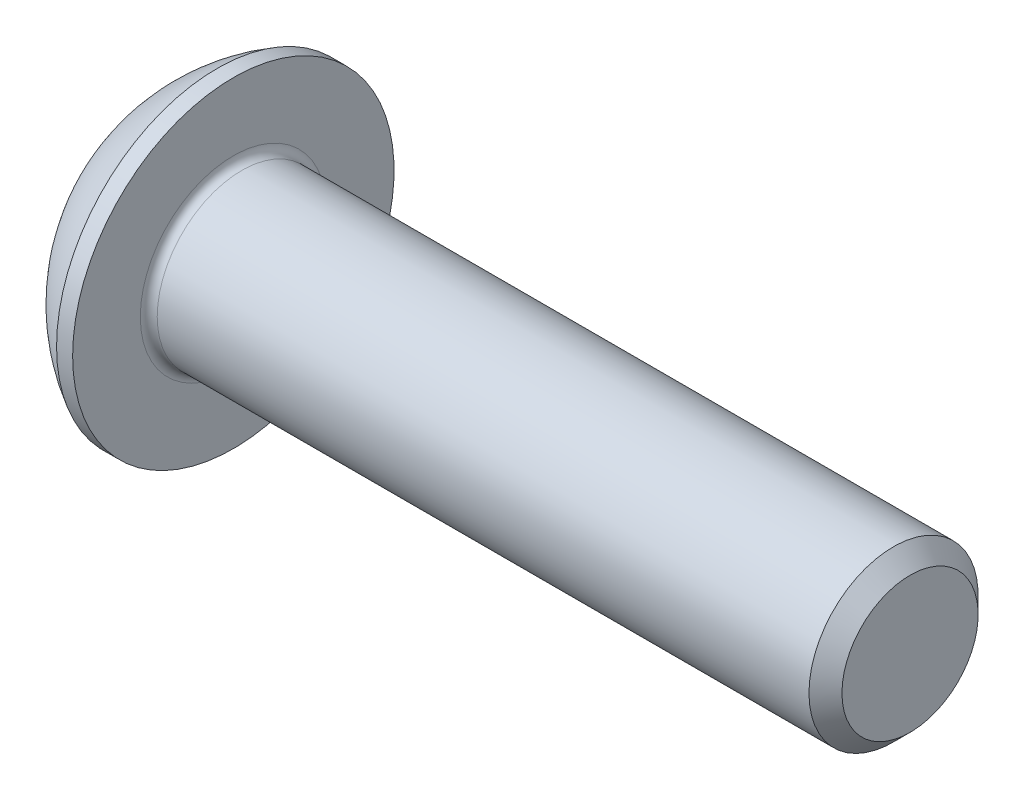
ISO-10303-21;
HEADER;
FILE_DESCRIPTION(('STEP AP214'),'2;1');
FILE_NAME('part.step','',(''),(''),'','','');
FILE_SCHEMA(('AUTOMOTIVE_DESIGN { 1 0 10303 214 1 1 1 1 }'));
ENDSEC;
DATA;
#1=APPLICATION_CONTEXT('core data for automotive mechanical design processes');
#2=APPLICATION_PROTOCOL_DEFINITION('international standard','automotive_design',2000,#1);
#3=PRODUCT_CONTEXT('',#1,'mechanical');
#4=PRODUCT('Part','Part','',(#3));
#5=PRODUCT_RELATED_PRODUCT_CATEGORY('part','',(#4));
#6=PRODUCT_DEFINITION_FORMATION('','',#4);
#7=PRODUCT_DEFINITION_CONTEXT('part definition',#1,'design');
#8=PRODUCT_DEFINITION('design','',#6,#7);
#9=PRODUCT_DEFINITION_SHAPE('','',#8);
#10=(LENGTH_UNIT() NAMED_UNIT(*) SI_UNIT(.MILLI.,.METRE.));
#11=(NAMED_UNIT(*) PLANE_ANGLE_UNIT() SI_UNIT($,.RADIAN.));
#12=(NAMED_UNIT(*) SI_UNIT($,.STERADIAN.) SOLID_ANGLE_UNIT());
#13=UNCERTAINTY_MEASURE_WITH_UNIT(LENGTH_MEASURE(1.E-05),#10,'distance_accuracy_value','');
#14=(GEOMETRIC_REPRESENTATION_CONTEXT(3) GLOBAL_UNCERTAINTY_ASSIGNED_CONTEXT((#13)) GLOBAL_UNIT_ASSIGNED_CONTEXT((#10,
#11,#12)) REPRESENTATION_CONTEXT('',''));
#15=CARTESIAN_POINT('',(0.,0.,0.));
#16=DIRECTION('',(0.,0.,1.));
#17=DIRECTION('',(1.,0.,0.));
#18=AXIS2_PLACEMENT_3D('',#15,#16,#17);
#19=CARTESIAN_POINT('',(0.,0.,0.));
#20=DIRECTION('',(-1.,0.,0.));
#21=DIRECTION('',(0.,0.,1.));
#22=AXIS2_PLACEMENT_3D('',#19,#20,#21);
#23=PLANE('',#22);
#24=CARTESIAN_POINT('',(0.,0.,0.));
#25=DIRECTION('',(-1.,0.,0.));
#26=DIRECTION('',(0.,0.,1.));
#27=AXIS2_PLACEMENT_3D('',#24,#25,#26);
#28=CIRCLE('',#27,1.9);
#29=CARTESIAN_POINT('',(0.,0.,1.9));
#30=VERTEX_POINT('',#29);
#31=EDGE_CURVE('E155',#30,#30,#28,.T.);
#32=ORIENTED_EDGE('',*,*,#31,.T.);
#33=EDGE_LOOP('',(#32));
#34=FACE_BOUND('',#33,.T.);
#35=DIRECTION('',(0.,-1.,0.));
#36=VECTOR('',#35,1.);
#37=CARTESIAN_POINT('',(0.,-0.721687836487032,1.25));
#38=LINE('',#37,#36);
#39=CARTESIAN_POINT('',(0.,0.721687836487033,1.25));
#40=VERTEX_POINT('',#39);
#41=CARTESIAN_POINT('',(0.,-0.721687836487032,1.25));
#42=VERTEX_POINT('',#41);
#43=EDGE_CURVE('E45',#40,#42,#38,.T.);
#44=ORIENTED_EDGE('',*,*,#43,.T.);
#45=DIRECTION('',(0.,-0.499999999999999,-0.866025403784439));
#46=VECTOR('',#45,1.);
#47=CARTESIAN_POINT('',(0.,-1.44337567297406,0.));
#48=LINE('',#47,#46);
#49=CARTESIAN_POINT('',(0.,-1.44337567297406,0.));
#50=VERTEX_POINT('',#49);
#51=EDGE_CURVE('E248',#42,#50,#48,.T.);
#52=ORIENTED_EDGE('',*,*,#51,.T.);
#53=DIRECTION('',(0.,0.5,-0.866025403784439));
#54=VECTOR('',#53,1.);
#55=CARTESIAN_POINT('',(0.,-0.721687836487031,-1.25));
#56=LINE('',#55,#54);
#57=CARTESIAN_POINT('',(0.,-0.721687836487031,-1.25));
#58=VERTEX_POINT('',#57);
#59=EDGE_CURVE('E130',#50,#58,#56,.T.);
#60=ORIENTED_EDGE('',*,*,#59,.T.);
#61=DIRECTION('',(0.,1.,0.));
#62=VECTOR('',#61,1.);
#63=CARTESIAN_POINT('',(0.,0.721687836487033,-1.25));
#64=LINE('',#63,#62);
#65=CARTESIAN_POINT('',(0.,0.721687836487033,-1.25));
#66=VERTEX_POINT('',#65);
#67=EDGE_CURVE('E251',#58,#66,#64,.T.);
#68=ORIENTED_EDGE('',*,*,#67,.T.);
#69=DIRECTION('',(0.,0.5,0.866025403784439));
#70=VECTOR('',#69,1.);
#71=CARTESIAN_POINT('',(0.,1.44337567297407,0.));
#72=LINE('',#71,#70);
#73=CARTESIAN_POINT('',(0.,1.44337567297407,0.));
#74=VERTEX_POINT('',#73);
#75=EDGE_CURVE('E253',#66,#74,#72,.T.);
#76=ORIENTED_EDGE('',*,*,#75,.T.);
#77=DIRECTION('',(0.,-0.5,0.866025403784439));
#78=VECTOR('',#77,1.);
#79=CARTESIAN_POINT('',(0.,0.721687836487033,1.25));
#80=LINE('',#79,#78);
#81=EDGE_CURVE('E255',#74,#40,#80,.T.);
#82=ORIENTED_EDGE('',*,*,#81,.T.);
#83=EDGE_LOOP('',(#44,#52,#60,#68,#76,#82));
#84=FACE_BOUND('',#83,.T.);
#85=ADVANCED_FACE('F30',(#34,#84),#23,.T.);
#86=CARTESIAN_POINT('',(3.88527472527473,0.,0.));
#87=DIRECTION('',(-1.,0.,0.));
#88=DIRECTION('',(0.,1.,0.));
#89=AXIS2_PLACEMENT_3D('',#86,#87,#88);
#90=SPHERICAL_SURFACE('',#89,4.32496932831421);
#91=CARTESIAN_POINT('',(1.82,0.,0.));
#92=DIRECTION('',(-1.,0.,0.));
#93=DIRECTION('',(0.,0.,1.));
#94=AXIS2_PLACEMENT_3D('',#91,#92,#93);
#95=CIRCLE('',#94,3.8);
#96=CARTESIAN_POINT('',(1.82,0.,3.8));
#97=VERTEX_POINT('',#96);
#98=EDGE_CURVE('E152',#97,#97,#95,.T.);
#99=ORIENTED_EDGE('',*,*,#98,.T.);
#100=EDGE_LOOP('',(#99));
#101=FACE_BOUND('',#100,.T.);
#102=ORIENTED_EDGE('',*,*,#31,.F.);
#103=EDGE_LOOP('',(#102));
#104=FACE_BOUND('',#103,.T.);
#105=ADVANCED_FACE('F176',(#101,#104),#90,.T.);
#106=CARTESIAN_POINT('',(0.,0.,0.));
#107=DIRECTION('',(-1.,0.,0.));
#108=DIRECTION('',(0.,0.,1.));
#109=AXIS2_PLACEMENT_3D('',#106,#107,#108);
#110=CYLINDRICAL_SURFACE('',#109,3.8);
#111=ORIENTED_EDGE('',*,*,#98,.F.);
#112=EDGE_LOOP('',(#111));
#113=FACE_BOUND('',#112,.T.);
#114=CARTESIAN_POINT('',(2.2,0.,0.));
#115=DIRECTION('',(-1.,0.,0.));
#116=DIRECTION('',(0.,0.,1.));
#117=AXIS2_PLACEMENT_3D('',#114,#115,#116);
#118=CIRCLE('',#117,3.8);
#119=CARTESIAN_POINT('',(2.2,0.,3.8));
#120=VERTEX_POINT('',#119);
#121=EDGE_CURVE('E149',#120,#120,#118,.T.);
#122=ORIENTED_EDGE('',*,*,#121,.T.);
#123=EDGE_LOOP('',(#122));
#124=FACE_BOUND('',#123,.T.);
#125=ADVANCED_FACE('F181',(#113,#124),#110,.T.);
#126=CARTESIAN_POINT('',(2.2,2.,0.));
#127=DIRECTION('',(-1.,0.,0.));
#128=DIRECTION('',(0.,0.,1.));
#129=AXIS2_PLACEMENT_3D('',#126,#127,#128);
#130=PLANE('',#129);
#131=CARTESIAN_POINT('',(2.2,0.,0.));
#132=DIRECTION('',(-1.,0.,0.));
#133=DIRECTION('',(0.,0.,1.));
#134=AXIS2_PLACEMENT_3D('',#131,#132,#133);
#135=CIRCLE('',#134,2.2);
#136=CARTESIAN_POINT('',(2.2,0.,2.2));
#137=VERTEX_POINT('',#136);
#138=EDGE_CURVE('E38',#137,#137,#135,.T.);
#139=ORIENTED_EDGE('',*,*,#138,.T.);
#140=EDGE_LOOP('',(#139));
#141=FACE_BOUND('',#140,.T.);
#142=ORIENTED_EDGE('',*,*,#121,.F.);
#143=EDGE_LOOP('',(#142));
#144=FACE_BOUND('',#143,.T.);
#145=ADVANCED_FACE('F160',(#141,#144),#130,.F.);
#146=CARTESIAN_POINT('',(0.,0.,0.));
#147=DIRECTION('',(-1.,0.,0.));
#148=DIRECTION('',(0.,0.,1.));
#149=AXIS2_PLACEMENT_3D('',#146,#147,#148);
#150=CYLINDRICAL_SURFACE('',#149,2.);
#151=CARTESIAN_POINT('',(2.4,0.,0.));
#152=DIRECTION('',(-1.,0.,0.));
#153=DIRECTION('',(0.,0.,1.));
#154=AXIS2_PLACEMENT_3D('',#151,#152,#153);
#155=CIRCLE('',#154,2.);
#156=CARTESIAN_POINT('',(2.4,0.,2.));
#157=VERTEX_POINT('',#156);
#158=EDGE_CURVE('E11',#157,#157,#155,.F.);
#159=ORIENTED_EDGE('',*,*,#158,.T.);
#160=EDGE_LOOP('',(#159));
#161=FACE_BOUND('',#160,.T.);
#162=CARTESIAN_POINT('',(17.81,0.,0.));
#163=DIRECTION('',(-1.,0.,0.));
#164=DIRECTION('',(0.,0.,1.));
#165=AXIS2_PLACEMENT_3D('',#162,#163,#164);
#166=CIRCLE('',#165,2.);
#167=CARTESIAN_POINT('',(17.81,0.,2.));
#168=VERTEX_POINT('',#167);
#169=EDGE_CURVE('E146',#168,#168,#166,.T.);
#170=ORIENTED_EDGE('',*,*,#169,.T.);
#171=EDGE_LOOP('',(#170));
#172=FACE_BOUND('',#171,.T.);
#173=ADVANCED_FACE('F190',(#161,#172),#150,.T.);
#174=CARTESIAN_POINT('',(18.2,0.,0.));
#175=DIRECTION('',(-1.,0.,0.));
#176=DIRECTION('',(0.,0.,1.));
#177=AXIS2_PLACEMENT_3D('',#174,#175,#176);
#178=CONICAL_SURFACE('',#177,1.61,0.78539816339746);
#179=ORIENTED_EDGE('',*,*,#169,.F.);
#180=EDGE_LOOP('',(#179));
#181=FACE_BOUND('',#180,.T.);
#182=CARTESIAN_POINT('',(18.2,0.,0.));
#183=DIRECTION('',(-1.,0.,0.));
#184=DIRECTION('',(0.,0.,1.));
#185=AXIS2_PLACEMENT_3D('',#182,#183,#184);
#186=CIRCLE('',#185,1.61);
#187=CARTESIAN_POINT('',(18.2,0.,1.61));
#188=VERTEX_POINT('',#187);
#189=EDGE_CURVE('E142',#188,#188,#186,.T.);
#190=ORIENTED_EDGE('',*,*,#189,.T.);
#191=EDGE_LOOP('',(#190));
#192=FACE_BOUND('',#191,.T.);
#193=ADVANCED_FACE('F171',(#181,#192),#178,.T.);
#194=CARTESIAN_POINT('',(18.2,0.,0.));
#195=DIRECTION('',(-1.,0.,0.));
#196=DIRECTION('',(0.,0.,1.));
#197=AXIS2_PLACEMENT_3D('',#194,#195,#196);
#198=PLANE('',#197);
#199=ORIENTED_EDGE('',*,*,#189,.F.);
#200=EDGE_LOOP('',(#199));
#201=FACE_BOUND('',#200,.T.);
#202=ADVANCED_FACE('F164',(#201),#198,.F.);
#203=CARTESIAN_POINT('',(2.4,0.,0.));
#204=DIRECTION('',(-1.,0.,0.));
#205=DIRECTION('',(0.,0.,1.));
#206=AXIS2_PLACEMENT_3D('',#203,#204,#205);
#207=TOROIDAL_SURFACE('',#206,2.2,0.2);
#208=ORIENTED_EDGE('',*,*,#158,.F.);
#209=EDGE_LOOP('',(#208));
#210=FACE_BOUND('',#209,.T.);
#211=ORIENTED_EDGE('',*,*,#138,.F.);
#212=EDGE_LOOP('',(#211));
#213=FACE_BOUND('',#212,.T.);
#214=ADVANCED_FACE('F32',(#210,#213),#207,.F.);
#215=CARTESIAN_POINT('',(1.3,-1.44337567297406,0.));
#216=DIRECTION('',(0.,0.866025403784439,-0.499999999999999));
#217=DIRECTION('',(0.,0.499999999999999,0.866025403784439));
#218=AXIS2_PLACEMENT_3D('',#215,#216,#217);
#219=PLANE('',#218);
#220=DIRECTION('',(0.,-0.499999999999999,-0.866025403784439));
#221=VECTOR('',#220,1.);
#222=CARTESIAN_POINT('',(1.3,-1.44337567297406,0.));
#223=LINE('',#222,#221);
#224=CARTESIAN_POINT('',(1.3,-0.721687836487032,1.25));
#225=VERTEX_POINT('',#224);
#226=CARTESIAN_POINT('',(1.3,-1.08253175473055,0.624999999999999));
#227=VERTEX_POINT('',#226);
#228=EDGE_CURVE('E113',#225,#227,#223,.T.);
#229=ORIENTED_EDGE('',*,*,#228,.T.);
#230=CARTESIAN_POINT('',(1.3,-1.44337567297406,0.));
#231=VERTEX_POINT('',#230);
#232=EDGE_CURVE('E106',#227,#231,#223,.T.);
#233=ORIENTED_EDGE('',*,*,#232,.T.);
#234=DIRECTION('',(-1.,0.,0.));
#235=VECTOR('',#234,1.);
#236=CARTESIAN_POINT('',(1.3,-1.44337567297406,0.));
#237=LINE('',#236,#235);
#238=EDGE_CURVE('E110',#231,#50,#237,.T.);
#239=ORIENTED_EDGE('',*,*,#238,.T.);
#240=ORIENTED_EDGE('',*,*,#51,.F.);
#241=DIRECTION('',(-1.,0.,0.));
#242=VECTOR('',#241,1.);
#243=CARTESIAN_POINT('',(1.3,-0.721687836487032,1.25));
#244=LINE('',#243,#242);
#245=EDGE_CURVE('E238',#225,#42,#244,.T.);
#246=ORIENTED_EDGE('',*,*,#245,.F.);
#247=EDGE_LOOP('',(#229,#233,#239,#240,#246));
#248=FACE_BOUND('',#247,.T.);
#249=ADVANCED_FACE('F108',(#248),#219,.T.);
#250=CARTESIAN_POINT('',(1.3,-0.721687836487031,-1.25));
#251=DIRECTION('',(0.,0.866025403784439,0.5));
#252=DIRECTION('',(0.,-0.5,0.866025403784439));
#253=AXIS2_PLACEMENT_3D('',#250,#251,#252);
#254=PLANE('',#253);
#255=DIRECTION('',(0.,0.5,-0.866025403784439));
#256=VECTOR('',#255,1.);
#257=CARTESIAN_POINT('',(1.3,-0.721687836487031,-1.25));
#258=LINE('',#257,#256);
#259=CARTESIAN_POINT('',(1.3,-1.08253175473055,-0.624999999999999));
#260=VERTEX_POINT('',#259);
#261=EDGE_CURVE('E118',#231,#260,#258,.T.);
#262=ORIENTED_EDGE('',*,*,#261,.T.);
#263=CARTESIAN_POINT('',(1.3,-0.721687836487031,-1.25));
#264=VERTEX_POINT('',#263);
#265=EDGE_CURVE('E125',#260,#264,#258,.T.);
#266=ORIENTED_EDGE('',*,*,#265,.T.);
#267=DIRECTION('',(-1.,0.,0.));
#268=VECTOR('',#267,1.);
#269=CARTESIAN_POINT('',(1.3,-0.721687836487031,-1.25));
#270=LINE('',#269,#268);
#271=EDGE_CURVE('E132',#264,#58,#270,.T.);
#272=ORIENTED_EDGE('',*,*,#271,.T.);
#273=ORIENTED_EDGE('',*,*,#59,.F.);
#274=ORIENTED_EDGE('',*,*,#238,.F.);
#275=EDGE_LOOP('',(#262,#266,#272,#273,#274));
#276=FACE_BOUND('',#275,.T.);
#277=ADVANCED_FACE('F128',(#276),#254,.T.);
#278=CARTESIAN_POINT('',(1.3,0.721687836487033,-1.25));
#279=DIRECTION('',(0.,0.,1.));
#280=DIRECTION('',(0.,-1.,0.));
#281=AXIS2_PLACEMENT_3D('',#278,#279,#280);
#282=PLANE('',#281);
#283=DIRECTION('',(0.,1.,0.));
#284=VECTOR('',#283,1.);
#285=CARTESIAN_POINT('',(1.3,0.721687836487033,-1.25));
#286=LINE('',#285,#284);
#287=CARTESIAN_POINT('',(1.3,0.,-1.25));
#288=VERTEX_POINT('',#287);
#289=EDGE_CURVE('E274',#264,#288,#286,.T.);
#290=ORIENTED_EDGE('',*,*,#289,.T.);
#291=CARTESIAN_POINT('',(1.3,0.721687836487033,-1.25));
#292=VERTEX_POINT('',#291);
#293=EDGE_CURVE('E124',#288,#292,#286,.T.);
#294=ORIENTED_EDGE('',*,*,#293,.T.);
#295=DIRECTION('',(-1.,0.,0.));
#296=VECTOR('',#295,1.);
#297=CARTESIAN_POINT('',(1.3,0.721687836487033,-1.25));
#298=LINE('',#297,#296);
#299=EDGE_CURVE('E137',#292,#66,#298,.T.);
#300=ORIENTED_EDGE('',*,*,#299,.T.);
#301=ORIENTED_EDGE('',*,*,#67,.F.);
#302=ORIENTED_EDGE('',*,*,#271,.F.);
#303=EDGE_LOOP('',(#290,#294,#300,#301,#302));
#304=FACE_BOUND('',#303,.T.);
#305=ADVANCED_FACE('F204',(#304),#282,.T.);
#306=CARTESIAN_POINT('',(1.3,1.44337567297407,0.));
#307=DIRECTION('',(0.,-0.866025403784439,0.5));
#308=DIRECTION('',(0.,-0.5,-0.866025403784439));
#309=AXIS2_PLACEMENT_3D('',#306,#307,#308);
#310=PLANE('',#309);
#311=DIRECTION('',(0.,0.5,0.866025403784439));
#312=VECTOR('',#311,1.);
#313=CARTESIAN_POINT('',(1.3,1.44337567297407,0.));
#314=LINE('',#313,#312);
#315=CARTESIAN_POINT('',(1.3,1.08253175473055,-0.625));
#316=VERTEX_POINT('',#315);
#317=EDGE_CURVE('E280',#292,#316,#314,.T.);
#318=ORIENTED_EDGE('',*,*,#317,.T.);
#319=CARTESIAN_POINT('',(1.3,1.44337567297407,0.));
#320=VERTEX_POINT('',#319);
#321=EDGE_CURVE('E278',#316,#320,#314,.T.);
#322=ORIENTED_EDGE('',*,*,#321,.T.);
#323=DIRECTION('',(-1.,0.,0.));
#324=VECTOR('',#323,1.);
#325=CARTESIAN_POINT('',(1.3,1.44337567297407,0.));
#326=LINE('',#325,#324);
#327=EDGE_CURVE('E260',#320,#74,#326,.T.);
#328=ORIENTED_EDGE('',*,*,#327,.T.);
#329=ORIENTED_EDGE('',*,*,#75,.F.);
#330=ORIENTED_EDGE('',*,*,#299,.F.);
#331=EDGE_LOOP('',(#318,#322,#328,#329,#330));
#332=FACE_BOUND('',#331,.T.);
#333=ADVANCED_FACE('F207',(#332),#310,.T.);
#334=CARTESIAN_POINT('',(1.3,0.721687836487033,1.25));
#335=DIRECTION('',(0.,-0.866025403784439,-0.5));
#336=DIRECTION('',(0.,0.5,-0.866025403784439));
#337=AXIS2_PLACEMENT_3D('',#334,#335,#336);
#338=PLANE('',#337);
#339=DIRECTION('',(0.,-0.5,0.866025403784439));
#340=VECTOR('',#339,1.);
#341=CARTESIAN_POINT('',(1.3,0.721687836487033,1.25));
#342=LINE('',#341,#340);
#343=CARTESIAN_POINT('',(1.3,1.08253175473055,0.625000000000001));
#344=VERTEX_POINT('',#343);
#345=EDGE_CURVE('E244',#320,#344,#342,.T.);
#346=ORIENTED_EDGE('',*,*,#345,.T.);
#347=CARTESIAN_POINT('',(1.3,0.721687836487033,1.25));
#348=VERTEX_POINT('',#347);
#349=EDGE_CURVE('E236',#344,#348,#342,.T.);
#350=ORIENTED_EDGE('',*,*,#349,.T.);
#351=DIRECTION('',(-1.,0.,0.));
#352=VECTOR('',#351,1.);
#353=CARTESIAN_POINT('',(1.3,0.721687836487033,1.25));
#354=LINE('',#353,#352);
#355=EDGE_CURVE('E242',#348,#40,#354,.T.);
#356=ORIENTED_EDGE('',*,*,#355,.T.);
#357=ORIENTED_EDGE('',*,*,#81,.F.);
#358=ORIENTED_EDGE('',*,*,#327,.F.);
#359=EDGE_LOOP('',(#346,#350,#356,#357,#358));
#360=FACE_BOUND('',#359,.T.);
#361=ADVANCED_FACE('F211',(#360),#338,.T.);
#362=CARTESIAN_POINT('',(1.3,-0.721687836487032,1.25));
#363=DIRECTION('',(0.,0.,-1.));
#364=DIRECTION('',(0.,1.,0.));
#365=AXIS2_PLACEMENT_3D('',#362,#363,#364);
#366=PLANE('',#365);
#367=DIRECTION('',(0.,-1.,0.));
#368=VECTOR('',#367,1.);
#369=CARTESIAN_POINT('',(1.3,-0.721687836487032,1.25));
#370=LINE('',#369,#368);
#371=CARTESIAN_POINT('',(1.3,0.,1.25));
#372=VERTEX_POINT('',#371);
#373=EDGE_CURVE('E53',#348,#372,#370,.T.);
#374=ORIENTED_EDGE('',*,*,#373,.T.);
#375=EDGE_CURVE('E239',#372,#225,#370,.T.);
#376=ORIENTED_EDGE('',*,*,#375,.T.);
#377=ORIENTED_EDGE('',*,*,#245,.T.);
#378=ORIENTED_EDGE('',*,*,#43,.F.);
#379=ORIENTED_EDGE('',*,*,#355,.F.);
#380=EDGE_LOOP('',(#374,#376,#377,#378,#379));
#381=FACE_BOUND('',#380,.T.);
#382=ADVANCED_FACE('F215',(#381),#366,.T.);
#383=CARTESIAN_POINT('',(1.3,-0.721687836487032,1.25));
#384=DIRECTION('',(-1.,0.,0.));
#385=DIRECTION('',(0.,0.,1.));
#386=AXIS2_PLACEMENT_3D('',#383,#384,#385);
#387=PLANE('',#386);
#388=ORIENTED_EDGE('',*,*,#373,.F.);
#389=ORIENTED_EDGE('',*,*,#349,.F.);
#390=CARTESIAN_POINT('',(1.3,0.,0.));
#391=DIRECTION('',(-1.,0.,0.));
#392=DIRECTION('',(0.,0.,1.));
#393=AXIS2_PLACEMENT_3D('',#390,#391,#392);
#394=CIRCLE('',#393,1.25);
#395=EDGE_CURVE('E136',#372,#344,#394,.T.);
#396=ORIENTED_EDGE('',*,*,#395,.F.);
#397=EDGE_LOOP('',(#388,#389,#396));
#398=FACE_BOUND('',#397,.T.);
#399=ADVANCED_FACE('F219',(#398),#387,.T.);
#400=ORIENTED_EDGE('',*,*,#345,.F.);
#401=ORIENTED_EDGE('',*,*,#321,.F.);
#402=EDGE_CURVE('E143',#344,#316,#394,.T.);
#403=ORIENTED_EDGE('',*,*,#402,.F.);
#404=EDGE_LOOP('',(#400,#401,#403));
#405=FACE_BOUND('',#404,.T.);
#406=ADVANCED_FACE('F227',(#405),#387,.T.);
#407=ORIENTED_EDGE('',*,*,#317,.F.);
#408=ORIENTED_EDGE('',*,*,#293,.F.);
#409=EDGE_CURVE('E285',#316,#288,#394,.T.);
#410=ORIENTED_EDGE('',*,*,#409,.F.);
#411=EDGE_LOOP('',(#407,#408,#410));
#412=FACE_BOUND('',#411,.T.);
#413=ADVANCED_FACE('F232',(#412),#387,.T.);
#414=ORIENTED_EDGE('',*,*,#289,.F.);
#415=ORIENTED_EDGE('',*,*,#265,.F.);
#416=EDGE_CURVE('E277',#288,#260,#394,.T.);
#417=ORIENTED_EDGE('',*,*,#416,.F.);
#418=EDGE_LOOP('',(#414,#415,#417));
#419=FACE_BOUND('',#418,.T.);
#420=ADVANCED_FACE('F225',(#419),#387,.T.);
#421=ORIENTED_EDGE('',*,*,#261,.F.);
#422=ORIENTED_EDGE('',*,*,#232,.F.);
#423=EDGE_CURVE('E120',#260,#227,#394,.T.);
#424=ORIENTED_EDGE('',*,*,#423,.F.);
#425=EDGE_LOOP('',(#421,#422,#424));
#426=FACE_BOUND('',#425,.T.);
#427=ADVANCED_FACE('F119',(#426),#387,.T.);
#428=ORIENTED_EDGE('',*,*,#228,.F.);
#429=ORIENTED_EDGE('',*,*,#375,.F.);
#430=EDGE_CURVE('E131',#227,#372,#394,.T.);
#431=ORIENTED_EDGE('',*,*,#430,.F.);
#432=EDGE_LOOP('',(#428,#429,#431));
#433=FACE_BOUND('',#432,.T.);
#434=ADVANCED_FACE('F199',(#433),#387,.T.);
#435=CARTESIAN_POINT('',(2.02168783648704,0.,0.));
#436=DIRECTION('',(-1.,0.,0.));
#437=DIRECTION('',(0.,0.,1.));
#438=AXIS2_PLACEMENT_3D('',#435,#436,#437);
#439=CONICAL_SURFACE('',#438,0.,1.04719755119659);
#440=ORIENTED_EDGE('',*,*,#395,.T.);
#441=ORIENTED_EDGE('',*,*,#402,.T.);
#442=ORIENTED_EDGE('',*,*,#409,.T.);
#443=ORIENTED_EDGE('',*,*,#416,.T.);
#444=ORIENTED_EDGE('',*,*,#423,.T.);
#445=ORIENTED_EDGE('',*,*,#430,.T.);
#446=EDGE_LOOP('',(#440,#441,#442,#443,#444,#445));
#447=FACE_BOUND('',#446,.T.);
#448=CARTESIAN_POINT('',(2.02168783648704,0.,0.));
#449=VERTEX_POINT('',#448);
#450=VERTEX_LOOP('',#449);
#451=FACE_BOUND('',#450,.T.);
#452=ADVANCED_FACE('F197',(#447,#451),#439,.F.);
#453=CLOSED_SHELL('',(#85,#105,#125,#145,#173,#193,#202,#214,#249,#277,#305,#333,#361,#382,#399,
#406,#413,#420,#427,#434,#452));
#454=MANIFOLD_SOLID_BREP('B2',#453);
#455=ADVANCED_BREP_SHAPE_REPRESENTATION('',(#18,#454),#14);
#456=SHAPE_DEFINITION_REPRESENTATION(#9,#455);
ENDSEC;
END-ISO-10303-21;
